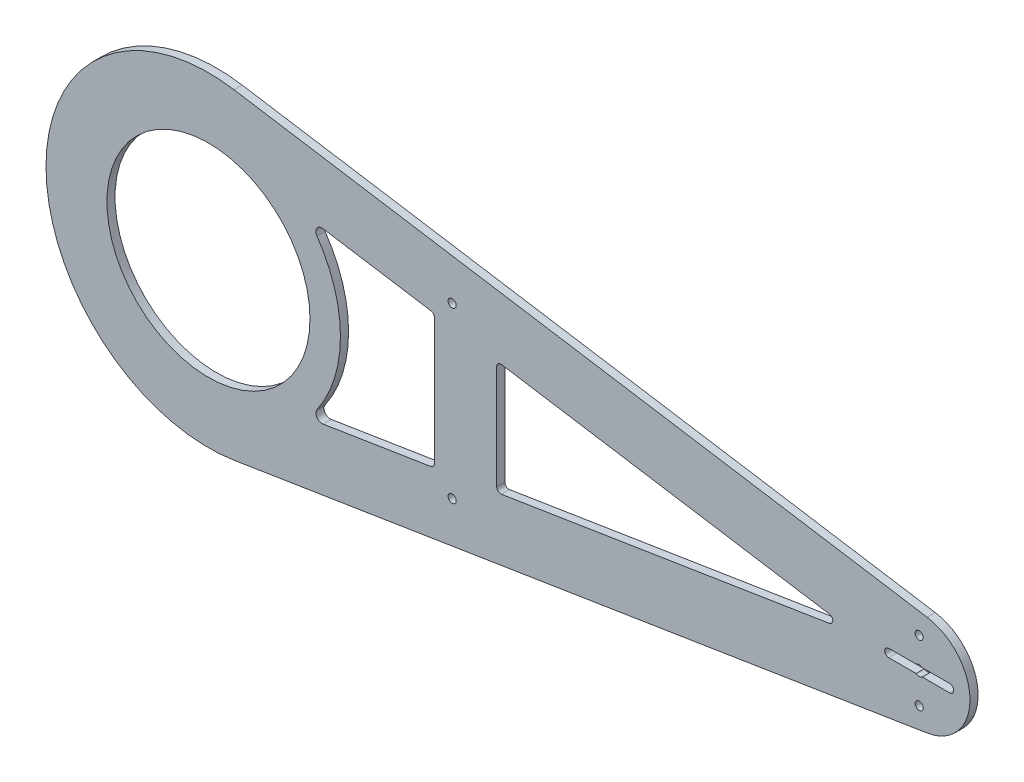
ISO-10303-21;
HEADER;
FILE_DESCRIPTION(('STEP AP214'),'2;1');
FILE_NAME('part.step','',(''),(''),'','','');
FILE_SCHEMA(('AUTOMOTIVE_DESIGN { 1 0 10303 214 1 1 1 1 }'));
ENDSEC;
DATA;
#1=APPLICATION_CONTEXT('core data for automotive mechanical design processes');
#2=APPLICATION_PROTOCOL_DEFINITION('international standard','automotive_design',2000,#1);
#3=PRODUCT_CONTEXT('',#1,'mechanical');
#4=PRODUCT('Part','Part','',(#3));
#5=PRODUCT_RELATED_PRODUCT_CATEGORY('part','',(#4));
#6=PRODUCT_DEFINITION_FORMATION('','',#4);
#7=PRODUCT_DEFINITION_CONTEXT('part definition',#1,'design');
#8=PRODUCT_DEFINITION('design','',#6,#7);
#9=PRODUCT_DEFINITION_SHAPE('','',#8);
#10=(LENGTH_UNIT() NAMED_UNIT(*) SI_UNIT(.MILLI.,.METRE.));
#11=(NAMED_UNIT(*) PLANE_ANGLE_UNIT() SI_UNIT($,.RADIAN.));
#12=(NAMED_UNIT(*) SI_UNIT($,.STERADIAN.) SOLID_ANGLE_UNIT());
#13=UNCERTAINTY_MEASURE_WITH_UNIT(LENGTH_MEASURE(1.E-05),#10,'distance_accuracy_value','');
#14=(GEOMETRIC_REPRESENTATION_CONTEXT(3) GLOBAL_UNCERTAINTY_ASSIGNED_CONTEXT((#13)) GLOBAL_UNIT_ASSIGNED_CONTEXT((#10,
#11,#12)) REPRESENTATION_CONTEXT('',''));
#15=CARTESIAN_POINT('',(0.,0.,0.));
#16=DIRECTION('',(0.,0.,1.));
#17=DIRECTION('',(1.,0.,0.));
#18=AXIS2_PLACEMENT_3D('',#15,#16,#17);
#19=CARTESIAN_POINT('',(0.,0.,-4.));
#20=DIRECTION('',(0.,0.,1.));
#21=DIRECTION('',(1.,0.,0.));
#22=AXIS2_PLACEMENT_3D('',#19,#20,#21);
#23=PLANE('',#22);
#24=CARTESIAN_POINT('',(0.,0.,-4.));
#25=DIRECTION('',(0.,0.,1.));
#26=DIRECTION('',(1.,0.,0.));
#27=AXIS2_PLACEMENT_3D('',#24,#25,#26);
#28=CIRCLE('',#27,50.);
#29=CARTESIAN_POINT('',(50.,0.,-4.));
#30=VERTEX_POINT('',#29);
#31=EDGE_CURVE('E621',#30,#30,#28,.T.);
#32=ORIENTED_EDGE('',*,*,#31,.T.);
#33=EDGE_LOOP('',(#32));
#34=FACE_BOUND('',#33,.T.);
#35=CARTESIAN_POINT('',(120.,41.6604515138636,-4.));
#36=DIRECTION('',(0.,0.,1.));
#37=DIRECTION('',(1.,0.,0.));
#38=AXIS2_PLACEMENT_3D('',#35,#36,#37);
#39=CIRCLE('',#38,2.);
#40=CARTESIAN_POINT('',(122.,41.6604515138636,-4.));
#41=VERTEX_POINT('',#40);
#42=EDGE_CURVE('E634',#41,#41,#39,.T.);
#43=ORIENTED_EDGE('',*,*,#42,.T.);
#44=EDGE_LOOP('',(#43));
#45=FACE_BOUND('',#44,.T.);
#46=CARTESIAN_POINT('',(120.,-41.6604515138637,-4.));
#47=DIRECTION('',(0.,0.,1.));
#48=DIRECTION('',(1.,0.,0.));
#49=AXIS2_PLACEMENT_3D('',#46,#47,#48);
#50=CIRCLE('',#49,2.);
#51=CARTESIAN_POINT('',(122.,-41.6604515138637,-4.));
#52=VERTEX_POINT('',#51);
#53=EDGE_CURVE('E630',#52,#52,#50,.T.);
#54=ORIENTED_EDGE('',*,*,#53,.T.);
#55=EDGE_LOOP('',(#54));
#56=FACE_BOUND('',#55,.T.);
#57=CARTESIAN_POINT('',(350.,15.,-4.));
#58=DIRECTION('',(0.,0.,1.));
#59=DIRECTION('',(1.,0.,0.));
#60=AXIS2_PLACEMENT_3D('',#57,#58,#59);
#61=CIRCLE('',#60,2.);
#62=CARTESIAN_POINT('',(352.,15.,-4.));
#63=VERTEX_POINT('',#62);
#64=EDGE_CURVE('E367',#63,#63,#61,.T.);
#65=ORIENTED_EDGE('',*,*,#64,.T.);
#66=EDGE_LOOP('',(#65));
#67=FACE_BOUND('',#66,.T.);
#68=CARTESIAN_POINT('',(350.,-15.,-4.));
#69=DIRECTION('',(0.,0.,1.));
#70=DIRECTION('',(1.,0.,0.));
#71=AXIS2_PLACEMENT_3D('',#68,#69,#70);
#72=CIRCLE('',#71,1.99999999999994);
#73=CARTESIAN_POINT('',(352.,-15.,-4.));
#74=VERTEX_POINT('',#73);
#75=EDGE_CURVE('E361',#74,#74,#72,.T.);
#76=ORIENTED_EDGE('',*,*,#75,.T.);
#77=EDGE_LOOP('',(#76));
#78=FACE_BOUND('',#77,.T.);
#79=DIRECTION('',(0.,-1.,0.));
#80=VECTOR('',#79,1.);
#81=CARTESIAN_POINT('',(141.940088648361,0.,-4.));
#82=LINE('',#81,#80);
#83=CARTESIAN_POINT('',(141.940088648361,25.7001448479802,-4.));
#84=VERTEX_POINT('',#83);
#85=CARTESIAN_POINT('',(141.940088648361,-25.7001448479802,-4.));
#86=VERTEX_POINT('',#85);
#87=EDGE_CURVE('E354',#84,#86,#82,.T.);
#88=ORIENTED_EDGE('',*,*,#87,.T.);
#89=CARTESIAN_POINT('',(143.940088648361,-25.7001448479802,-4.));
#90=DIRECTION('',(0.,0.,1.));
#91=DIRECTION('',(1.,0.,0.));
#92=AXIS2_PLACEMENT_3D('',#89,#90,#91);
#93=CIRCLE('',#92,2.);
#94=CARTESIAN_POINT('',(144.254374362647,-27.6752966117178,-4.));
#95=VERTEX_POINT('',#94);
#96=EDGE_CURVE('E444',#86,#95,#93,.T.);
#97=ORIENTED_EDGE('',*,*,#96,.T.);
#98=DIRECTION('',(0.987575881868821,0.157142857142857,0.));
#99=VECTOR('',#98,1.);
#100=CARTESIAN_POINT('',(7.85714285714286,-49.3787940934411,-4.));
#101=LINE('',#100,#99);
#102=CARTESIAN_POINT('',(305.768831168831,-1.97515176373764,-4.));
#103=VERTEX_POINT('',#102);
#104=EDGE_CURVE('E357',#95,#103,#101,.T.);
#105=ORIENTED_EDGE('',*,*,#104,.T.);
#106=CARTESIAN_POINT('',(305.454545454546,0.,-4.));
#107=DIRECTION('',(0.,0.,1.));
#108=DIRECTION('',(1.,0.,0.));
#109=AXIS2_PLACEMENT_3D('',#106,#107,#108);
#110=CIRCLE('',#109,2.);
#111=CARTESIAN_POINT('',(305.768831168831,1.97515176373764,-4.));
#112=VERTEX_POINT('',#111);
#113=EDGE_CURVE('E12',#103,#112,#110,.T.);
#114=ORIENTED_EDGE('',*,*,#113,.T.);
#115=DIRECTION('',(-0.987575881868821,0.157142857142857,0.));
#116=VECTOR('',#115,1.);
#117=CARTESIAN_POINT('',(7.85714285714286,49.3787940934411,-4.));
#118=LINE('',#117,#116);
#119=CARTESIAN_POINT('',(144.254374362647,27.6752966117178,-4.));
#120=VERTEX_POINT('',#119);
#121=EDGE_CURVE('E359',#112,#120,#118,.T.);
#122=ORIENTED_EDGE('',*,*,#121,.T.);
#123=CARTESIAN_POINT('',(143.940088648361,25.7001448479802,-4.));
#124=DIRECTION('',(0.,0.,1.));
#125=DIRECTION('',(1.,0.,0.));
#126=AXIS2_PLACEMENT_3D('',#123,#124,#125);
#127=CIRCLE('',#126,2.);
#128=EDGE_CURVE('E448',#120,#84,#127,.T.);
#129=ORIENTED_EDGE('',*,*,#128,.T.);
#130=EDGE_LOOP('',(#88,#97,#105,#114,#122,#129));
#131=FACE_BOUND('',#130,.T.);
#132=DIRECTION('',(0.987575881868821,0.157142857142857,0.));
#133=VECTOR('',#132,1.);
#134=CARTESIAN_POINT('',(7.85714285714287,-49.3787940934411,-4.));
#135=LINE('',#134,#133);
#136=CARTESIAN_POINT('',(56.389238275683,-41.656377743249,-4.));
#137=VERTEX_POINT('',#136);
#138=CARTESIAN_POINT('',(109.609148615213,-33.1880373137372,-4.));
#139=VERTEX_POINT('',#138);
#140=EDGE_CURVE('E346',#137,#139,#135,.T.);
#141=ORIENTED_EDGE('',*,*,#140,.T.);
#142=CARTESIAN_POINT('',(109.294862900928,-31.2128855499996,-4.));
#143=DIRECTION('',(0.,0.,1.));
#144=DIRECTION('',(1.,0.,0.));
#145=AXIS2_PLACEMENT_3D('',#142,#143,#144);
#146=CIRCLE('',#145,2.);
#147=CARTESIAN_POINT('',(111.294862900928,-31.2128855499996,-4.));
#148=VERTEX_POINT('',#147);
#149=EDGE_CURVE('E440',#139,#148,#146,.T.);
#150=ORIENTED_EDGE('',*,*,#149,.T.);
#151=DIRECTION('',(0.,1.,0.));
#152=VECTOR('',#151,1.);
#153=CARTESIAN_POINT('',(111.294862900928,0.,-4.));
#154=LINE('',#153,#152);
#155=CARTESIAN_POINT('',(111.294862900928,31.2128855499996,-4.));
#156=VERTEX_POINT('',#155);
#157=EDGE_CURVE('E349',#148,#156,#154,.T.);
#158=ORIENTED_EDGE('',*,*,#157,.T.);
#159=CARTESIAN_POINT('',(109.294862900928,31.2128855499996,-4.));
#160=DIRECTION('',(0.,0.,1.));
#161=DIRECTION('',(1.,0.,0.));
#162=AXIS2_PLACEMENT_3D('',#159,#160,#161);
#163=CIRCLE('',#162,2.);
#164=CARTESIAN_POINT('',(109.609148615213,33.1880373137372,-4.));
#165=VERTEX_POINT('',#164);
#166=EDGE_CURVE('E436',#156,#165,#163,.T.);
#167=ORIENTED_EDGE('',*,*,#166,.T.);
#168=DIRECTION('',(-0.987575881868821,0.157142857142857,0.));
#169=VECTOR('',#168,1.);
#170=CARTESIAN_POINT('',(7.85714285714287,49.3787940934411,-4.));
#171=LINE('',#170,#169);
#172=CARTESIAN_POINT('',(56.389238275683,41.656377743249,-4.));
#173=VERTEX_POINT('',#172);
#174=EDGE_CURVE('E352',#165,#173,#171,.T.);
#175=ORIENTED_EDGE('',*,*,#174,.T.);
#176=CARTESIAN_POINT('',(55.9178097042545,38.6936500976425,-4.));
#177=DIRECTION('',(0.,0.,1.));
#178=DIRECTION('',(1.,0.,0.));
#179=AXIS2_PLACEMENT_3D('',#176,#177,#178);
#180=CIRCLE('',#179,3.00000000000002);
#181=CARTESIAN_POINT('',(53.4508475114197,36.9865772992171,-4.));
#182=VERTEX_POINT('',#181);
#183=EDGE_CURVE('E289',#173,#182,#180,.T.);
#184=ORIENTED_EDGE('',*,*,#183,.T.);
#185=CARTESIAN_POINT('',(0.,0.,-4.));
#186=DIRECTION('',(0.,0.,1.));
#187=DIRECTION('',(1.,0.,0.));
#188=AXIS2_PLACEMENT_3D('',#185,#186,#187);
#189=CIRCLE('',#188,65.);
#190=CARTESIAN_POINT('',(53.4508475114197,-36.9865772992171,-4.));
#191=VERTEX_POINT('',#190);
#192=EDGE_CURVE('E293',#182,#191,#189,.F.);
#193=ORIENTED_EDGE('',*,*,#192,.T.);
#194=CARTESIAN_POINT('',(55.9178097042545,-38.6936500976425,-4.));
#195=DIRECTION('',(0.,0.,1.));
#196=DIRECTION('',(1.,0.,0.));
#197=AXIS2_PLACEMENT_3D('',#194,#195,#196);
#198=CIRCLE('',#197,3.00000000000002);
#199=EDGE_CURVE('E343',#191,#137,#198,.T.);
#200=ORIENTED_EDGE('',*,*,#199,.T.);
#201=EDGE_LOOP('',(#141,#150,#158,#167,#175,#184,#193,#200));
#202=FACE_BOUND('',#201,.T.);
#203=CARTESIAN_POINT('',(0.,0.,-4.));
#204=DIRECTION('',(0.,0.,1.));
#205=DIRECTION('',(1.,0.,0.));
#206=AXIS2_PLACEMENT_3D('',#203,#204,#205);
#207=CIRCLE('',#206,80.);
#208=CARTESIAN_POINT('',(12.5714285714286,79.0060705495057,-4.));
#209=VERTEX_POINT('',#208);
#210=CARTESIAN_POINT('',(12.5714285714286,-79.0060705495057,-4.));
#211=VERTEX_POINT('',#210);
#212=EDGE_CURVE('E379',#209,#211,#207,.T.);
#213=ORIENTED_EDGE('',*,*,#212,.F.);
#214=DIRECTION('',(-0.987575881868821,0.157142857142857,0.));
#215=VECTOR('',#214,1.);
#216=CARTESIAN_POINT('',(12.5714285714286,79.0060705495057,-4.));
#217=LINE('',#216,#215);
#218=CARTESIAN_POINT('',(353.928571428571,24.6893970467205,-4.));
#219=VERTEX_POINT('',#218);
#220=EDGE_CURVE('E389',#219,#209,#217,.T.);
#221=ORIENTED_EDGE('',*,*,#220,.F.);
#222=CARTESIAN_POINT('',(350.,0.,-4.));
#223=DIRECTION('',(0.,0.,1.));
#224=DIRECTION('',(1.,0.,0.));
#225=AXIS2_PLACEMENT_3D('',#222,#223,#224);
#226=CIRCLE('',#225,25.);
#227=CARTESIAN_POINT('',(353.928571428571,-24.6893970467205,-4.));
#228=VERTEX_POINT('',#227);
#229=EDGE_CURVE('E386',#228,#219,#226,.T.);
#230=ORIENTED_EDGE('',*,*,#229,.F.);
#231=DIRECTION('',(0.987575881868821,0.157142857142857,0.));
#232=VECTOR('',#231,1.);
#233=CARTESIAN_POINT('',(12.5714285714286,-79.0060705495057,-4.));
#234=LINE('',#233,#232);
#235=EDGE_CURVE('E382',#211,#228,#234,.T.);
#236=ORIENTED_EDGE('',*,*,#235,.F.);
#237=EDGE_LOOP('',(#213,#221,#230,#236));
#238=FACE_BOUND('',#237,.T.);
#239=DIRECTION('',(1.,0.,0.));
#240=VECTOR('',#239,1.);
#241=CARTESIAN_POINT('',(0.,1.99999999999879,-4.));
#242=LINE('',#241,#240);
#243=CARTESIAN_POINT('',(351.5,2.00000000000006,-4.));
#244=VERTEX_POINT('',#243);
#245=CARTESIAN_POINT('',(365.,2.,-4.));
#246=VERTEX_POINT('',#245);
#247=EDGE_CURVE('E267',#244,#246,#242,.T.);
#248=ORIENTED_EDGE('',*,*,#247,.F.);
#249=CARTESIAN_POINT('',(350.,0.,-4.));
#250=DIRECTION('',(0.,0.,1.));
#251=DIRECTION('',(1.,0.,0.));
#252=AXIS2_PLACEMENT_3D('',#249,#250,#251);
#253=CIRCLE('',#252,2.50000000000002);
#254=CARTESIAN_POINT('',(348.5,2.00000000000005,-4.));
#255=VERTEX_POINT('',#254);
#256=EDGE_CURVE('E375',#244,#255,#253,.T.);
#257=ORIENTED_EDGE('',*,*,#256,.T.);
#258=DIRECTION('',(1.,0.,0.));
#259=VECTOR('',#258,1.);
#260=CARTESIAN_POINT('',(0.,1.99999999999879,-4.));
#261=LINE('',#260,#259);
#262=CARTESIAN_POINT('',(335.,2.,-4.));
#263=VERTEX_POINT('',#262);
#264=EDGE_CURVE('E650',#263,#255,#261,.T.);
#265=ORIENTED_EDGE('',*,*,#264,.F.);
#266=CARTESIAN_POINT('',(335.,0.,-4.));
#267=DIRECTION('',(0.,0.,1.));
#268=DIRECTION('',(1.,0.,0.));
#269=AXIS2_PLACEMENT_3D('',#266,#267,#268);
#270=CIRCLE('',#269,2.);
#271=CARTESIAN_POINT('',(335.,-2.,-4.));
#272=VERTEX_POINT('',#271);
#273=EDGE_CURVE('E364',#263,#272,#270,.T.);
#274=ORIENTED_EDGE('',*,*,#273,.T.);
#275=DIRECTION('',(1.,0.,0.));
#276=VECTOR('',#275,1.);
#277=CARTESIAN_POINT('',(0.,-1.99999999999879,-4.));
#278=LINE('',#277,#276);
#279=CARTESIAN_POINT('',(348.5,-2.00000000000005,-4.));
#280=VERTEX_POINT('',#279);
#281=EDGE_CURVE('E637',#272,#280,#278,.T.);
#282=ORIENTED_EDGE('',*,*,#281,.T.);
#283=CARTESIAN_POINT('',(351.5,-2.00000000000006,-4.));
#284=VERTEX_POINT('',#283);
#285=EDGE_CURVE('E374',#280,#284,#253,.T.);
#286=ORIENTED_EDGE('',*,*,#285,.T.);
#287=DIRECTION('',(1.,0.,0.));
#288=VECTOR('',#287,1.);
#289=CARTESIAN_POINT('',(0.,-1.99999999999879,-4.));
#290=LINE('',#289,#288);
#291=CARTESIAN_POINT('',(365.,-2.,-4.));
#292=VERTEX_POINT('',#291);
#293=EDGE_CURVE('E639',#284,#292,#290,.T.);
#294=ORIENTED_EDGE('',*,*,#293,.T.);
#295=CARTESIAN_POINT('',(365.,0.,-4.));
#296=DIRECTION('',(0.,0.,1.));
#297=DIRECTION('',(1.,0.,0.));
#298=AXIS2_PLACEMENT_3D('',#295,#296,#297);
#299=CIRCLE('',#298,2.);
#300=EDGE_CURVE('E370',#292,#246,#299,.T.);
#301=ORIENTED_EDGE('',*,*,#300,.T.);
#302=EDGE_LOOP('',(#248,#257,#265,#274,#282,#286,#294,#301));
#303=FACE_BOUND('',#302,.T.);
#304=ADVANCED_FACE('F89',(#34,#45,#56,#67,#78,#131,#202,#238,#303),#23,.F.);
#305=CARTESIAN_POINT('',(0.,0.,0.));
#306=DIRECTION('',(0.,0.,1.));
#307=DIRECTION('',(1.,0.,0.));
#308=AXIS2_PLACEMENT_3D('',#305,#306,#307);
#309=PLANE('',#308);
#310=CARTESIAN_POINT('',(0.,0.,0.));
#311=DIRECTION('',(0.,0.,1.));
#312=DIRECTION('',(1.,0.,0.));
#313=AXIS2_PLACEMENT_3D('',#310,#311,#312);
#314=CIRCLE('',#313,50.);
#315=CARTESIAN_POINT('',(50.,0.,0.));
#316=VERTEX_POINT('',#315);
#317=EDGE_CURVE('E619',#316,#316,#314,.T.);
#318=ORIENTED_EDGE('',*,*,#317,.F.);
#319=EDGE_LOOP('',(#318));
#320=FACE_BOUND('',#319,.T.);
#321=CARTESIAN_POINT('',(120.,41.6604515138636,0.));
#322=DIRECTION('',(0.,0.,1.));
#323=DIRECTION('',(1.,0.,0.));
#324=AXIS2_PLACEMENT_3D('',#321,#322,#323);
#325=CIRCLE('',#324,2.);
#326=CARTESIAN_POINT('',(122.,41.6604515138636,0.));
#327=VERTEX_POINT('',#326);
#328=EDGE_CURVE('E625',#327,#327,#325,.T.);
#329=ORIENTED_EDGE('',*,*,#328,.F.);
#330=EDGE_LOOP('',(#329));
#331=FACE_BOUND('',#330,.T.);
#332=CARTESIAN_POINT('',(120.,-41.6604515138637,0.));
#333=DIRECTION('',(0.,0.,1.));
#334=DIRECTION('',(1.,0.,0.));
#335=AXIS2_PLACEMENT_3D('',#332,#333,#334);
#336=CIRCLE('',#335,2.);
#337=CARTESIAN_POINT('',(122.,-41.6604515138637,0.));
#338=VERTEX_POINT('',#337);
#339=EDGE_CURVE('E622',#338,#338,#336,.T.);
#340=ORIENTED_EDGE('',*,*,#339,.F.);
#341=EDGE_LOOP('',(#340));
#342=FACE_BOUND('',#341,.T.);
#343=CARTESIAN_POINT('',(350.,15.,0.));
#344=DIRECTION('',(0.,0.,1.));
#345=DIRECTION('',(1.,0.,0.));
#346=AXIS2_PLACEMENT_3D('',#343,#344,#345);
#347=CIRCLE('',#346,2.);
#348=CARTESIAN_POINT('',(352.,15.,0.));
#349=VERTEX_POINT('',#348);
#350=EDGE_CURVE('E306',#349,#349,#347,.T.);
#351=ORIENTED_EDGE('',*,*,#350,.F.);
#352=EDGE_LOOP('',(#351));
#353=FACE_BOUND('',#352,.T.);
#354=CARTESIAN_POINT('',(350.,-15.,0.));
#355=DIRECTION('',(0.,0.,1.));
#356=DIRECTION('',(1.,0.,0.));
#357=AXIS2_PLACEMENT_3D('',#354,#355,#356);
#358=CIRCLE('',#357,1.99999999999994);
#359=CARTESIAN_POINT('',(352.,-15.,0.));
#360=VERTEX_POINT('',#359);
#361=EDGE_CURVE('E305',#360,#360,#358,.T.);
#362=ORIENTED_EDGE('',*,*,#361,.F.);
#363=EDGE_LOOP('',(#362));
#364=FACE_BOUND('',#363,.T.);
#365=DIRECTION('',(-0.987575881868821,0.157142857142857,0.));
#366=VECTOR('',#365,1.);
#367=CARTESIAN_POINT('',(141.940088648361,28.043545245635,0.));
#368=LINE('',#367,#366);
#369=CARTESIAN_POINT('',(305.768831168831,1.97515176373765,0.));
#370=VERTEX_POINT('',#369);
#371=CARTESIAN_POINT('',(144.254374362647,27.6752966117178,0.));
#372=VERTEX_POINT('',#371);
#373=EDGE_CURVE('E310',#370,#372,#368,.T.);
#374=ORIENTED_EDGE('',*,*,#373,.F.);
#375=CARTESIAN_POINT('',(305.454545454546,0.,0.));
#376=DIRECTION('',(0.,0.,1.));
#377=DIRECTION('',(1.,0.,0.));
#378=AXIS2_PLACEMENT_3D('',#375,#376,#377);
#379=CIRCLE('',#378,2.);
#380=CARTESIAN_POINT('',(305.768831168831,-1.97515176373765,0.));
#381=VERTEX_POINT('',#380);
#382=EDGE_CURVE('E97',#370,#381,#379,.F.);
#383=ORIENTED_EDGE('',*,*,#382,.T.);
#384=DIRECTION('',(0.987575881868821,0.157142857142857,0.));
#385=VECTOR('',#384,1.);
#386=CARTESIAN_POINT('',(141.940088648361,-28.043545245635,0.));
#387=LINE('',#386,#385);
#388=CARTESIAN_POINT('',(144.254374362647,-27.6752966117178,0.));
#389=VERTEX_POINT('',#388);
#390=EDGE_CURVE('E290',#389,#381,#387,.T.);
#391=ORIENTED_EDGE('',*,*,#390,.F.);
#392=CARTESIAN_POINT('',(143.940088648361,-25.7001448479802,0.));
#393=DIRECTION('',(0.,0.,1.));
#394=DIRECTION('',(1.,0.,0.));
#395=AXIS2_PLACEMENT_3D('',#392,#393,#394);
#396=CIRCLE('',#395,2.);
#397=CARTESIAN_POINT('',(141.940088648361,-25.7001448479802,0.));
#398=VERTEX_POINT('',#397);
#399=EDGE_CURVE('E442',#389,#398,#396,.F.);
#400=ORIENTED_EDGE('',*,*,#399,.T.);
#401=DIRECTION('',(0.,-1.,0.));
#402=VECTOR('',#401,1.);
#403=CARTESIAN_POINT('',(141.940088648361,28.043545245635,0.));
#404=LINE('',#403,#402);
#405=CARTESIAN_POINT('',(141.940088648361,25.7001448479802,0.));
#406=VERTEX_POINT('',#405);
#407=EDGE_CURVE('E296',#406,#398,#404,.T.);
#408=ORIENTED_EDGE('',*,*,#407,.F.);
#409=CARTESIAN_POINT('',(143.940088648361,25.7001448479802,0.));
#410=DIRECTION('',(0.,0.,1.));
#411=DIRECTION('',(1.,0.,0.));
#412=AXIS2_PLACEMENT_3D('',#409,#410,#411);
#413=CIRCLE('',#412,2.);
#414=EDGE_CURVE('E446',#406,#372,#413,.F.);
#415=ORIENTED_EDGE('',*,*,#414,.T.);
#416=EDGE_LOOP('',(#374,#383,#391,#400,#408,#415));
#417=FACE_BOUND('',#416,.T.);
#418=DIRECTION('',(-0.987575881868821,0.157142857142857,0.));
#419=VECTOR('',#418,1.);
#420=CARTESIAN_POINT('',(56.389238275683,41.656377743249,0.));
#421=LINE('',#420,#419);
#422=CARTESIAN_POINT('',(109.609148615213,33.1880373137372,0.));
#423=VERTEX_POINT('',#422);
#424=CARTESIAN_POINT('',(56.389238275683,41.656377743249,0.));
#425=VERTEX_POINT('',#424);
#426=EDGE_CURVE('E316',#423,#425,#421,.T.);
#427=ORIENTED_EDGE('',*,*,#426,.F.);
#428=CARTESIAN_POINT('',(109.294862900928,31.2128855499996,0.));
#429=DIRECTION('',(0.,0.,1.));
#430=DIRECTION('',(1.,0.,0.));
#431=AXIS2_PLACEMENT_3D('',#428,#429,#430);
#432=CIRCLE('',#431,2.);
#433=CARTESIAN_POINT('',(111.294862900928,31.2128855499996,0.));
#434=VERTEX_POINT('',#433);
#435=EDGE_CURVE('E434',#423,#434,#432,.F.);
#436=ORIENTED_EDGE('',*,*,#435,.T.);
#437=DIRECTION('',(0.,1.,0.));
#438=VECTOR('',#437,1.);
#439=CARTESIAN_POINT('',(111.294862900928,32.9198068273037,0.));
#440=LINE('',#439,#438);
#441=CARTESIAN_POINT('',(111.294862900928,-31.2128855499996,0.));
#442=VERTEX_POINT('',#441);
#443=EDGE_CURVE('E330',#442,#434,#440,.T.);
#444=ORIENTED_EDGE('',*,*,#443,.F.);
#445=CARTESIAN_POINT('',(109.294862900928,-31.2128855499996,0.));
#446=DIRECTION('',(0.,0.,1.));
#447=DIRECTION('',(1.,0.,0.));
#448=AXIS2_PLACEMENT_3D('',#445,#446,#447);
#449=CIRCLE('',#448,2.);
#450=CARTESIAN_POINT('',(109.609148615213,-33.1880373137372,0.));
#451=VERTEX_POINT('',#450);
#452=EDGE_CURVE('E438',#442,#451,#449,.F.);
#453=ORIENTED_EDGE('',*,*,#452,.T.);
#454=DIRECTION('',(0.987575881868821,0.157142857142857,0.));
#455=VECTOR('',#454,1.);
#456=CARTESIAN_POINT('',(56.389238275683,-41.656377743249,0.));
#457=LINE('',#456,#455);
#458=CARTESIAN_POINT('',(56.389238275683,-41.656377743249,0.));
#459=VERTEX_POINT('',#458);
#460=EDGE_CURVE('E327',#459,#451,#457,.T.);
#461=ORIENTED_EDGE('',*,*,#460,.F.);
#462=CARTESIAN_POINT('',(55.9178097042545,-38.6936500976425,0.));
#463=DIRECTION('',(0.,0.,1.));
#464=DIRECTION('',(1.,0.,0.));
#465=AXIS2_PLACEMENT_3D('',#462,#463,#464);
#466=CIRCLE('',#465,3.00000000000002);
#467=CARTESIAN_POINT('',(53.4508475114197,-36.9865772992171,0.));
#468=VERTEX_POINT('',#467);
#469=EDGE_CURVE('E324',#468,#459,#466,.T.);
#470=ORIENTED_EDGE('',*,*,#469,.F.);
#471=CARTESIAN_POINT('',(0.,0.,0.));
#472=DIRECTION('',(0.,0.,-1.));
#473=DIRECTION('',(1.,0.,0.));
#474=AXIS2_PLACEMENT_3D('',#471,#472,#473);
#475=CIRCLE('',#474,65.);
#476=CARTESIAN_POINT('',(53.4508475114197,36.9865772992171,0.));
#477=VERTEX_POINT('',#476);
#478=EDGE_CURVE('E321',#477,#468,#475,.T.);
#479=ORIENTED_EDGE('',*,*,#478,.F.);
#480=CARTESIAN_POINT('',(55.9178097042545,38.6936500976425,0.));
#481=DIRECTION('',(0.,0.,1.));
#482=DIRECTION('',(-1.,0.,0.));
#483=AXIS2_PLACEMENT_3D('',#480,#481,#482);
#484=CIRCLE('',#483,3.00000000000002);
#485=EDGE_CURVE('E318',#425,#477,#484,.T.);
#486=ORIENTED_EDGE('',*,*,#485,.F.);
#487=EDGE_LOOP('',(#427,#436,#444,#453,#461,#470,#479,#486));
#488=FACE_BOUND('',#487,.T.);
#489=CARTESIAN_POINT('',(0.,0.,0.));
#490=DIRECTION('',(0.,0.,1.));
#491=DIRECTION('',(1.,0.,0.));
#492=AXIS2_PLACEMENT_3D('',#489,#490,#491);
#493=CIRCLE('',#492,80.);
#494=CARTESIAN_POINT('',(12.5714285714286,79.0060705495057,0.));
#495=VERTEX_POINT('',#494);
#496=CARTESIAN_POINT('',(12.5714285714286,-79.0060705495057,0.));
#497=VERTEX_POINT('',#496);
#498=EDGE_CURVE('E378',#495,#497,#493,.T.);
#499=ORIENTED_EDGE('',*,*,#498,.T.);
#500=DIRECTION('',(0.987575881868821,0.157142857142857,0.));
#501=VECTOR('',#500,1.);
#502=CARTESIAN_POINT('',(12.5714285714286,-79.0060705495057,0.));
#503=LINE('',#502,#501);
#504=CARTESIAN_POINT('',(353.928571428571,-24.6893970467205,0.));
#505=VERTEX_POINT('',#504);
#506=EDGE_CURVE('E395',#497,#505,#503,.T.);
#507=ORIENTED_EDGE('',*,*,#506,.T.);
#508=CARTESIAN_POINT('',(350.,0.,0.));
#509=DIRECTION('',(0.,0.,1.));
#510=DIRECTION('',(1.,0.,0.));
#511=AXIS2_PLACEMENT_3D('',#508,#509,#510);
#512=CIRCLE('',#511,25.);
#513=CARTESIAN_POINT('',(353.928571428571,24.6893970467205,0.));
#514=VERTEX_POINT('',#513);
#515=EDGE_CURVE('E398',#505,#514,#512,.T.);
#516=ORIENTED_EDGE('',*,*,#515,.T.);
#517=DIRECTION('',(-0.987575881868821,0.157142857142857,0.));
#518=VECTOR('',#517,1.);
#519=CARTESIAN_POINT('',(12.5714285714286,79.0060705495057,0.));
#520=LINE('',#519,#518);
#521=EDGE_CURVE('E383',#514,#495,#520,.T.);
#522=ORIENTED_EDGE('',*,*,#521,.T.);
#523=EDGE_LOOP('',(#499,#507,#516,#522));
#524=FACE_BOUND('',#523,.T.);
#525=CARTESIAN_POINT('',(350.,0.,0.));
#526=DIRECTION('',(0.,0.,1.));
#527=DIRECTION('',(1.,0.,0.));
#528=AXIS2_PLACEMENT_3D('',#525,#526,#527);
#529=CIRCLE('',#528,2.50000000000002);
#530=CARTESIAN_POINT('',(351.5,2.00000000000006,0.));
#531=VERTEX_POINT('',#530);
#532=CARTESIAN_POINT('',(348.5,2.,0.));
#533=VERTEX_POINT('',#532);
#534=EDGE_CURVE('E283',#531,#533,#529,.T.);
#535=ORIENTED_EDGE('',*,*,#534,.F.);
#536=DIRECTION('',(1.,0.,0.));
#537=VECTOR('',#536,1.);
#538=CARTESIAN_POINT('',(0.,2.00000000000006,0.));
#539=LINE('',#538,#537);
#540=CARTESIAN_POINT('',(365.,2.,0.));
#541=VERTEX_POINT('',#540);
#542=EDGE_CURVE('E264',#531,#541,#539,.T.);
#543=ORIENTED_EDGE('',*,*,#542,.T.);
#544=CARTESIAN_POINT('',(365.,0.,0.));
#545=DIRECTION('',(0.,0.,1.));
#546=DIRECTION('',(1.,0.,0.));
#547=AXIS2_PLACEMENT_3D('',#544,#545,#546);
#548=CIRCLE('',#547,2.);
#549=CARTESIAN_POINT('',(365.,-2.,0.));
#550=VERTEX_POINT('',#549);
#551=EDGE_CURVE('E280',#550,#541,#548,.T.);
#552=ORIENTED_EDGE('',*,*,#551,.F.);
#553=DIRECTION('',(1.,0.,0.));
#554=VECTOR('',#553,1.);
#555=CARTESIAN_POINT('',(0.,-2.00000000000006,0.));
#556=LINE('',#555,#554);
#557=CARTESIAN_POINT('',(351.5,-2.00000000000006,0.));
#558=VERTEX_POINT('',#557);
#559=EDGE_CURVE('E285',#558,#550,#556,.T.);
#560=ORIENTED_EDGE('',*,*,#559,.F.);
#561=CARTESIAN_POINT('',(348.5,-2.,0.));
#562=VERTEX_POINT('',#561);
#563=EDGE_CURVE('E372',#562,#558,#529,.T.);
#564=ORIENTED_EDGE('',*,*,#563,.F.);
#565=DIRECTION('',(1.,0.,0.));
#566=VECTOR('',#565,1.);
#567=CARTESIAN_POINT('',(0.,-2.,0.));
#568=LINE('',#567,#566);
#569=CARTESIAN_POINT('',(335.,-2.,0.));
#570=VERTEX_POINT('',#569);
#571=EDGE_CURVE('E647',#570,#562,#568,.T.);
#572=ORIENTED_EDGE('',*,*,#571,.F.);
#573=CARTESIAN_POINT('',(335.,0.,0.));
#574=DIRECTION('',(0.,0.,1.));
#575=DIRECTION('',(1.,0.,0.));
#576=AXIS2_PLACEMENT_3D('',#573,#574,#575);
#577=CIRCLE('',#576,2.);
#578=CARTESIAN_POINT('',(335.,2.,0.));
#579=VERTEX_POINT('',#578);
#580=EDGE_CURVE('E302',#579,#570,#577,.T.);
#581=ORIENTED_EDGE('',*,*,#580,.F.);
#582=DIRECTION('',(1.,0.,0.));
#583=VECTOR('',#582,1.);
#584=CARTESIAN_POINT('',(0.,2.,0.));
#585=LINE('',#584,#583);
#586=EDGE_CURVE('E649',#579,#533,#585,.T.);
#587=ORIENTED_EDGE('',*,*,#586,.T.);
#588=EDGE_LOOP('',(#535,#543,#552,#560,#564,#572,#581,#587));
#589=FACE_BOUND('',#588,.T.);
#590=ADVANCED_FACE('F278',(#320,#331,#342,#353,#364,#417,#488,#524,#589),#309,.T.);
#591=CARTESIAN_POINT('',(350.,0.,-10.));
#592=DIRECTION('',(0.,0.,1.));
#593=DIRECTION('',(1.,0.,0.));
#594=AXIS2_PLACEMENT_3D('',#591,#592,#593);
#595=CYLINDRICAL_SURFACE('',#594,2.50000000000002);
#596=DIRECTION('',(0.,0.,-1.));
#597=VECTOR('',#596,1.);
#598=CARTESIAN_POINT('',(351.5,2.00000000000006,-4.));
#599=LINE('',#598,#597);
#600=EDGE_CURVE('E272',#244,#531,#599,.F.);
#601=ORIENTED_EDGE('',*,*,#600,.T.);
#602=ORIENTED_EDGE('',*,*,#534,.T.);
#603=DIRECTION('',(0.,0.,-1.));
#604=VECTOR('',#603,1.);
#605=CARTESIAN_POINT('',(348.5,2.00000000000005,-4.));
#606=LINE('',#605,#604);
#607=EDGE_CURVE('E658',#255,#533,#606,.F.);
#608=ORIENTED_EDGE('',*,*,#607,.F.);
#609=ORIENTED_EDGE('',*,*,#256,.F.);
#610=EDGE_LOOP('',(#601,#602,#608,#609));
#611=FACE_BOUND('',#610,.T.);
#612=ADVANCED_FACE('F490',(#611),#595,.F.);
#613=DIRECTION('',(0.,0.,-1.));
#614=VECTOR('',#613,1.);
#615=CARTESIAN_POINT('',(351.5,-2.00000000000006,-4.));
#616=LINE('',#615,#614);
#617=EDGE_CURVE('E284',#284,#558,#616,.F.);
#618=ORIENTED_EDGE('',*,*,#617,.F.);
#619=ORIENTED_EDGE('',*,*,#285,.F.);
#620=DIRECTION('',(0.,0.,-1.));
#621=VECTOR('',#620,1.);
#622=CARTESIAN_POINT('',(348.5,-2.00000000000005,-4.));
#623=LINE('',#622,#621);
#624=EDGE_CURVE('E655',#280,#562,#623,.F.);
#625=ORIENTED_EDGE('',*,*,#624,.T.);
#626=ORIENTED_EDGE('',*,*,#563,.T.);
#627=EDGE_LOOP('',(#618,#619,#625,#626));
#628=FACE_BOUND('',#627,.T.);
#629=ADVANCED_FACE('F589',(#628),#595,.F.);
#630=CARTESIAN_POINT('',(335.,0.,-10.));
#631=DIRECTION('',(0.,0.,1.));
#632=DIRECTION('',(1.,0.,0.));
#633=AXIS2_PLACEMENT_3D('',#630,#631,#632);
#634=CYLINDRICAL_SURFACE('',#633,2.);
#635=DIRECTION('',(0.,0.,-1.));
#636=VECTOR('',#635,1.);
#637=CARTESIAN_POINT('',(335.,2.,-4.));
#638=LINE('',#637,#636);
#639=EDGE_CURVE('E642',#263,#579,#638,.F.);
#640=ORIENTED_EDGE('',*,*,#639,.T.);
#641=ORIENTED_EDGE('',*,*,#580,.T.);
#642=DIRECTION('',(0.,0.,-1.));
#643=VECTOR('',#642,1.);
#644=CARTESIAN_POINT('',(335.,-2.,-4.));
#645=LINE('',#644,#643);
#646=EDGE_CURVE('E300',#272,#570,#645,.F.);
#647=ORIENTED_EDGE('',*,*,#646,.F.);
#648=ORIENTED_EDGE('',*,*,#273,.F.);
#649=EDGE_LOOP('',(#640,#641,#647,#648));
#650=FACE_BOUND('',#649,.T.);
#651=ADVANCED_FACE('F514',(#650),#634,.F.);
#652=CARTESIAN_POINT('',(0.,0.,-4.));
#653=DIRECTION('',(0.,0.,1.));
#654=DIRECTION('',(1.,0.,0.));
#655=AXIS2_PLACEMENT_3D('',#652,#653,#654);
#656=CYLINDRICAL_SURFACE('',#655,80.);
#657=ORIENTED_EDGE('',*,*,#498,.F.);
#658=DIRECTION('',(0.,0.,1.));
#659=VECTOR('',#658,1.);
#660=CARTESIAN_POINT('',(12.5714285714286,79.0060705495057,-4.));
#661=LINE('',#660,#659);
#662=EDGE_CURVE('E403',#209,#495,#661,.T.);
#663=ORIENTED_EDGE('',*,*,#662,.F.);
#664=ORIENTED_EDGE('',*,*,#212,.T.);
#665=DIRECTION('',(0.,0.,1.));
#666=VECTOR('',#665,1.);
#667=CARTESIAN_POINT('',(12.5714285714286,-79.0060705495057,-4.));
#668=LINE('',#667,#666);
#669=EDGE_CURVE('E392',#211,#497,#668,.T.);
#670=ORIENTED_EDGE('',*,*,#669,.T.);
#671=EDGE_LOOP('',(#657,#663,#664,#670));
#672=FACE_BOUND('',#671,.T.);
#673=ADVANCED_FACE('F502',(#672),#656,.T.);
#674=CARTESIAN_POINT('',(12.5714285714286,79.0060705495057,-4.));
#675=DIRECTION('',(0.157142857142857,0.987575881868821,0.));
#676=DIRECTION('',(-0.987575881868821,0.157142857142857,0.));
#677=AXIS2_PLACEMENT_3D('',#674,#675,#676);
#678=PLANE('',#677);
#679=ORIENTED_EDGE('',*,*,#521,.F.);
#680=DIRECTION('',(0.,0.,1.));
#681=VECTOR('',#680,1.);
#682=CARTESIAN_POINT('',(353.928571428571,24.6893970467205,-4.));
#683=LINE('',#682,#681);
#684=EDGE_CURVE('E406',#219,#514,#683,.T.);
#685=ORIENTED_EDGE('',*,*,#684,.F.);
#686=ORIENTED_EDGE('',*,*,#220,.T.);
#687=ORIENTED_EDGE('',*,*,#662,.T.);
#688=EDGE_LOOP('',(#679,#685,#686,#687));
#689=FACE_BOUND('',#688,.T.);
#690=ADVANCED_FACE('F498',(#689),#678,.T.);
#691=CARTESIAN_POINT('',(350.,0.,-4.));
#692=DIRECTION('',(0.,0.,1.));
#693=DIRECTION('',(1.,0.,0.));
#694=AXIS2_PLACEMENT_3D('',#691,#692,#693);
#695=CYLINDRICAL_SURFACE('',#694,25.);
#696=ORIENTED_EDGE('',*,*,#515,.F.);
#697=DIRECTION('',(0.,0.,1.));
#698=VECTOR('',#697,1.);
#699=CARTESIAN_POINT('',(353.928571428571,-24.6893970467205,-4.));
#700=LINE('',#699,#698);
#701=EDGE_CURVE('E408',#228,#505,#700,.T.);
#702=ORIENTED_EDGE('',*,*,#701,.F.);
#703=ORIENTED_EDGE('',*,*,#229,.T.);
#704=ORIENTED_EDGE('',*,*,#684,.T.);
#705=EDGE_LOOP('',(#696,#702,#703,#704));
#706=FACE_BOUND('',#705,.T.);
#707=ADVANCED_FACE('F501',(#706),#695,.T.);
#708=CARTESIAN_POINT('',(12.5714285714286,-79.0060705495057,-4.));
#709=DIRECTION('',(0.157142857142857,-0.987575881868821,0.));
#710=DIRECTION('',(0.987575881868821,0.157142857142857,0.));
#711=AXIS2_PLACEMENT_3D('',#708,#709,#710);
#712=PLANE('',#711);
#713=ORIENTED_EDGE('',*,*,#506,.F.);
#714=ORIENTED_EDGE('',*,*,#669,.F.);
#715=ORIENTED_EDGE('',*,*,#235,.T.);
#716=ORIENTED_EDGE('',*,*,#701,.T.);
#717=EDGE_LOOP('',(#713,#714,#715,#716));
#718=FACE_BOUND('',#717,.T.);
#719=ADVANCED_FACE('F506',(#718),#712,.T.);
#720=CARTESIAN_POINT('',(56.389238275683,41.656377743249,-10.));
#721=DIRECTION('',(0.157142857142857,0.987575881868821,0.));
#722=DIRECTION('',(-0.987575881868821,0.157142857142857,0.));
#723=AXIS2_PLACEMENT_3D('',#720,#721,#722);
#724=PLANE('',#723);
#725=ORIENTED_EDGE('',*,*,#174,.F.);
#726=DIRECTION('',(0.,0.,1.));
#727=VECTOR('',#726,1.);
#728=CARTESIAN_POINT('',(109.609148615213,33.1880373137372,0.));
#729=LINE('',#728,#727);
#730=EDGE_CURVE('E405',#165,#423,#729,.T.);
#731=ORIENTED_EDGE('',*,*,#730,.T.);
#732=ORIENTED_EDGE('',*,*,#426,.T.);
#733=DIRECTION('',(0.,0.,1.));
#734=VECTOR('',#733,1.);
#735=CARTESIAN_POINT('',(56.389238275683,41.656377743249,-10.));
#736=LINE('',#735,#734);
#737=EDGE_CURVE('E333',#173,#425,#736,.T.);
#738=ORIENTED_EDGE('',*,*,#737,.F.);
#739=EDGE_LOOP('',(#725,#731,#732,#738));
#740=FACE_BOUND('',#739,.T.);
#741=ADVANCED_FACE('F510',(#740),#724,.F.);
#742=CARTESIAN_POINT('',(111.294862900928,32.9198068273037,-10.));
#743=DIRECTION('',(1.,0.,0.));
#744=DIRECTION('',(0.,0.,-1.));
#745=AXIS2_PLACEMENT_3D('',#742,#743,#744);
#746=PLANE('',#745);
#747=ORIENTED_EDGE('',*,*,#443,.T.);
#748=DIRECTION('',(0.,0.,1.));
#749=VECTOR('',#748,1.);
#750=CARTESIAN_POINT('',(111.294862900928,31.2128855499996,-4.));
#751=LINE('',#750,#749);
#752=EDGE_CURVE('E416',#434,#156,#751,.F.);
#753=ORIENTED_EDGE('',*,*,#752,.T.);
#754=ORIENTED_EDGE('',*,*,#157,.F.);
#755=DIRECTION('',(0.,0.,1.));
#756=VECTOR('',#755,1.);
#757=CARTESIAN_POINT('',(111.294862900928,-31.2128855499996,0.));
#758=LINE('',#757,#756);
#759=EDGE_CURVE('E413',#148,#442,#758,.T.);
#760=ORIENTED_EDGE('',*,*,#759,.T.);
#761=EDGE_LOOP('',(#747,#753,#754,#760));
#762=FACE_BOUND('',#761,.T.);
#763=ADVANCED_FACE('F555',(#762),#746,.F.);
#764=CARTESIAN_POINT('',(56.389238275683,-41.656377743249,-10.));
#765=DIRECTION('',(0.157142857142857,-0.987575881868821,0.));
#766=DIRECTION('',(0.987575881868821,0.157142857142857,0.));
#767=AXIS2_PLACEMENT_3D('',#764,#765,#766);
#768=PLANE('',#767);
#769=ORIENTED_EDGE('',*,*,#460,.T.);
#770=DIRECTION('',(0.,0.,1.));
#771=VECTOR('',#770,1.);
#772=CARTESIAN_POINT('',(109.609148615213,-33.1880373137372,-4.));
#773=LINE('',#772,#771);
#774=EDGE_CURVE('E418',#451,#139,#773,.F.);
#775=ORIENTED_EDGE('',*,*,#774,.T.);
#776=ORIENTED_EDGE('',*,*,#140,.F.);
#777=DIRECTION('',(0.,0.,1.));
#778=VECTOR('',#777,1.);
#779=CARTESIAN_POINT('',(56.389238275683,-41.656377743249,-10.));
#780=LINE('',#779,#778);
#781=EDGE_CURVE('E309',#137,#459,#780,.T.);
#782=ORIENTED_EDGE('',*,*,#781,.T.);
#783=EDGE_LOOP('',(#769,#775,#776,#782));
#784=FACE_BOUND('',#783,.T.);
#785=ADVANCED_FACE('F551',(#784),#768,.F.);
#786=CARTESIAN_POINT('',(55.9178097042545,-38.6936500976425,-10.));
#787=DIRECTION('',(0.,0.,1.));
#788=DIRECTION('',(1.,0.,0.));
#789=AXIS2_PLACEMENT_3D('',#786,#787,#788);
#790=CYLINDRICAL_SURFACE('',#789,3.00000000000002);
#791=DIRECTION('',(0.,0.,1.));
#792=VECTOR('',#791,1.);
#793=CARTESIAN_POINT('',(53.4508475114197,-36.9865772992171,-10.));
#794=LINE('',#793,#792);
#795=EDGE_CURVE('E335',#191,#468,#794,.T.);
#796=ORIENTED_EDGE('',*,*,#795,.T.);
#797=ORIENTED_EDGE('',*,*,#469,.T.);
#798=ORIENTED_EDGE('',*,*,#781,.F.);
#799=ORIENTED_EDGE('',*,*,#199,.F.);
#800=EDGE_LOOP('',(#796,#797,#798,#799));
#801=FACE_BOUND('',#800,.T.);
#802=ADVANCED_FACE('F549',(#801),#790,.F.);
#803=CARTESIAN_POINT('',(0.,0.,-10.));
#804=DIRECTION('',(0.,0.,1.));
#805=DIRECTION('',(1.,0.,0.));
#806=AXIS2_PLACEMENT_3D('',#803,#804,#805);
#807=CYLINDRICAL_SURFACE('',#806,65.);
#808=DIRECTION('',(0.,0.,1.));
#809=VECTOR('',#808,1.);
#810=CARTESIAN_POINT('',(53.4508475114197,36.9865772992171,-10.));
#811=LINE('',#810,#809);
#812=EDGE_CURVE('E337',#182,#477,#811,.T.);
#813=ORIENTED_EDGE('',*,*,#812,.T.);
#814=ORIENTED_EDGE('',*,*,#478,.T.);
#815=ORIENTED_EDGE('',*,*,#795,.F.);
#816=ORIENTED_EDGE('',*,*,#192,.F.);
#817=EDGE_LOOP('',(#813,#814,#815,#816));
#818=FACE_BOUND('',#817,.T.);
#819=ADVANCED_FACE('F544',(#818),#807,.T.);
#820=CARTESIAN_POINT('',(55.9178097042545,38.6936500976425,-10.));
#821=DIRECTION('',(0.,0.,1.));
#822=DIRECTION('',(1.,0.,0.));
#823=AXIS2_PLACEMENT_3D('',#820,#821,#822);
#824=CYLINDRICAL_SURFACE('',#823,3.00000000000002);
#825=ORIENTED_EDGE('',*,*,#737,.T.);
#826=ORIENTED_EDGE('',*,*,#485,.T.);
#827=ORIENTED_EDGE('',*,*,#812,.F.);
#828=ORIENTED_EDGE('',*,*,#183,.F.);
#829=EDGE_LOOP('',(#825,#826,#827,#828));
#830=FACE_BOUND('',#829,.T.);
#831=ADVANCED_FACE('F537',(#830),#824,.F.);
#832=CARTESIAN_POINT('',(141.940088648361,28.043545245635,-10.));
#833=DIRECTION('',(0.157142857142857,0.987575881868821,0.));
#834=DIRECTION('',(-0.987575881868821,0.157142857142857,0.));
#835=AXIS2_PLACEMENT_3D('',#832,#833,#834);
#836=PLANE('',#835);
#837=ORIENTED_EDGE('',*,*,#373,.T.);
#838=DIRECTION('',(0.,0.,1.));
#839=VECTOR('',#838,1.);
#840=CARTESIAN_POINT('',(144.254374362647,27.6752966117178,-4.));
#841=LINE('',#840,#839);
#842=EDGE_CURVE('E104',#372,#120,#841,.F.);
#843=ORIENTED_EDGE('',*,*,#842,.T.);
#844=ORIENTED_EDGE('',*,*,#121,.F.);
#845=DIRECTION('',(0.,0.,1.));
#846=VECTOR('',#845,1.);
#847=CARTESIAN_POINT('',(305.768831168831,1.97515176373764,0.));
#848=LINE('',#847,#846);
#849=EDGE_CURVE('E430',#112,#370,#848,.T.);
#850=ORIENTED_EDGE('',*,*,#849,.T.);
#851=EDGE_LOOP('',(#837,#843,#844,#850));
#852=FACE_BOUND('',#851,.T.);
#853=ADVANCED_FACE('F460',(#852),#836,.F.);
#854=CARTESIAN_POINT('',(141.940088648361,-28.043545245635,-10.));
#855=DIRECTION('',(0.157142857142857,-0.987575881868821,0.));
#856=DIRECTION('',(0.987575881868821,0.157142857142857,0.));
#857=AXIS2_PLACEMENT_3D('',#854,#855,#856);
#858=PLANE('',#857);
#859=ORIENTED_EDGE('',*,*,#104,.F.);
#860=DIRECTION('',(0.,0.,1.));
#861=VECTOR('',#860,1.);
#862=CARTESIAN_POINT('',(144.254374362647,-27.6752966117178,0.));
#863=LINE('',#862,#861);
#864=EDGE_CURVE('E422',#95,#389,#863,.T.);
#865=ORIENTED_EDGE('',*,*,#864,.T.);
#866=ORIENTED_EDGE('',*,*,#390,.T.);
#867=DIRECTION('',(0.,0.,1.));
#868=VECTOR('',#867,1.);
#869=CARTESIAN_POINT('',(305.768831168831,-1.97515176373764,-4.));
#870=LINE('',#869,#868);
#871=EDGE_CURVE('E420',#381,#103,#870,.F.);
#872=ORIENTED_EDGE('',*,*,#871,.T.);
#873=EDGE_LOOP('',(#859,#865,#866,#872));
#874=FACE_BOUND('',#873,.T.);
#875=ADVANCED_FACE('F458',(#874),#858,.F.);
#876=CARTESIAN_POINT('',(141.940088648361,28.043545245635,-10.));
#877=DIRECTION('',(-1.,0.,0.));
#878=DIRECTION('',(0.,0.,1.));
#879=AXIS2_PLACEMENT_3D('',#876,#877,#878);
#880=PLANE('',#879);
#881=ORIENTED_EDGE('',*,*,#407,.T.);
#882=DIRECTION('',(0.,0.,1.));
#883=VECTOR('',#882,1.);
#884=CARTESIAN_POINT('',(141.940088648361,-25.7001448479802,-4.));
#885=LINE('',#884,#883);
#886=EDGE_CURVE('E428',#398,#86,#885,.F.);
#887=ORIENTED_EDGE('',*,*,#886,.T.);
#888=ORIENTED_EDGE('',*,*,#87,.F.);
#889=DIRECTION('',(0.,0.,1.));
#890=VECTOR('',#889,1.);
#891=CARTESIAN_POINT('',(141.940088648361,25.7001448479802,0.));
#892=LINE('',#891,#890);
#893=EDGE_CURVE('E425',#84,#406,#892,.T.);
#894=ORIENTED_EDGE('',*,*,#893,.T.);
#895=EDGE_LOOP('',(#881,#887,#888,#894));
#896=FACE_BOUND('',#895,.T.);
#897=ADVANCED_FACE('F469',(#896),#880,.F.);
#898=CARTESIAN_POINT('',(350.,-15.,-10.));
#899=DIRECTION('',(0.,0.,1.));
#900=DIRECTION('',(1.,0.,0.));
#901=AXIS2_PLACEMENT_3D('',#898,#899,#900);
#902=CYLINDRICAL_SURFACE('',#901,1.99999999999994);
#903=ORIENTED_EDGE('',*,*,#361,.T.);
#904=EDGE_LOOP('',(#903));
#905=FACE_BOUND('',#904,.T.);
#906=ORIENTED_EDGE('',*,*,#75,.F.);
#907=EDGE_LOOP('',(#906));
#908=FACE_BOUND('',#907,.T.);
#909=ADVANCED_FACE('F565',(#905,#908),#902,.F.);
#910=CARTESIAN_POINT('',(350.,15.,-10.));
#911=DIRECTION('',(0.,0.,1.));
#912=DIRECTION('',(1.,0.,0.));
#913=AXIS2_PLACEMENT_3D('',#910,#911,#912);
#914=CYLINDRICAL_SURFACE('',#913,2.);
#915=ORIENTED_EDGE('',*,*,#350,.T.);
#916=EDGE_LOOP('',(#915));
#917=FACE_BOUND('',#916,.T.);
#918=ORIENTED_EDGE('',*,*,#64,.F.);
#919=EDGE_LOOP('',(#918));
#920=FACE_BOUND('',#919,.T.);
#921=ADVANCED_FACE('F583',(#917,#920),#914,.F.);
#922=CARTESIAN_POINT('',(365.,0.,-10.));
#923=DIRECTION('',(0.,0.,1.));
#924=DIRECTION('',(1.,0.,0.));
#925=AXIS2_PLACEMENT_3D('',#922,#923,#924);
#926=CYLINDRICAL_SURFACE('',#925,2.);
#927=ORIENTED_EDGE('',*,*,#551,.T.);
#928=DIRECTION('',(0.,0.,-1.));
#929=VECTOR('',#928,1.);
#930=CARTESIAN_POINT('',(365.,2.,-4.));
#931=LINE('',#930,#929);
#932=EDGE_CURVE('E261',#246,#541,#931,.F.);
#933=ORIENTED_EDGE('',*,*,#932,.F.);
#934=ORIENTED_EDGE('',*,*,#300,.F.);
#935=DIRECTION('',(0.,0.,-1.));
#936=VECTOR('',#935,1.);
#937=CARTESIAN_POINT('',(365.,-2.,-4.));
#938=LINE('',#937,#936);
#939=EDGE_CURVE('E273',#292,#550,#938,.F.);
#940=ORIENTED_EDGE('',*,*,#939,.T.);
#941=EDGE_LOOP('',(#927,#933,#934,#940));
#942=FACE_BOUND('',#941,.T.);
#943=ADVANCED_FACE('F288',(#942),#926,.F.);
#944=CARTESIAN_POINT('',(0.,-1.99999999999879,-4.));
#945=DIRECTION('',(0.,-1.,0.));
#946=DIRECTION('',(1.,0.,0.));
#947=AXIS2_PLACEMENT_3D('',#944,#945,#946);
#948=PLANE('',#947);
#949=ORIENTED_EDGE('',*,*,#939,.F.);
#950=ORIENTED_EDGE('',*,*,#293,.F.);
#951=ORIENTED_EDGE('',*,*,#617,.T.);
#952=ORIENTED_EDGE('',*,*,#559,.T.);
#953=EDGE_LOOP('',(#949,#950,#951,#952));
#954=FACE_BOUND('',#953,.T.);
#955=ADVANCED_FACE('F593',(#954),#948,.F.);
#956=CARTESIAN_POINT('',(0.,1.99999999999879,-4.));
#957=DIRECTION('',(0.,-1.,0.));
#958=DIRECTION('',(1.,0.,0.));
#959=AXIS2_PLACEMENT_3D('',#956,#957,#958);
#960=PLANE('',#959);
#961=ORIENTED_EDGE('',*,*,#600,.F.);
#962=ORIENTED_EDGE('',*,*,#247,.T.);
#963=ORIENTED_EDGE('',*,*,#932,.T.);
#964=ORIENTED_EDGE('',*,*,#542,.F.);
#965=EDGE_LOOP('',(#961,#962,#963,#964));
#966=FACE_BOUND('',#965,.T.);
#967=ADVANCED_FACE('F263',(#966),#960,.T.);
#968=CARTESIAN_POINT('',(0.,-1.99999999999879,-4.));
#969=DIRECTION('',(0.,-1.,0.));
#970=DIRECTION('',(1.,0.,0.));
#971=AXIS2_PLACEMENT_3D('',#968,#969,#970);
#972=PLANE('',#971);
#973=ORIENTED_EDGE('',*,*,#624,.F.);
#974=ORIENTED_EDGE('',*,*,#281,.F.);
#975=ORIENTED_EDGE('',*,*,#646,.T.);
#976=ORIENTED_EDGE('',*,*,#571,.T.);
#977=EDGE_LOOP('',(#973,#974,#975,#976));
#978=FACE_BOUND('',#977,.T.);
#979=ADVANCED_FACE('F597',(#978),#972,.F.);
#980=CARTESIAN_POINT('',(0.,1.99999999999879,-4.));
#981=DIRECTION('',(0.,-1.,0.));
#982=DIRECTION('',(1.,0.,0.));
#983=AXIS2_PLACEMENT_3D('',#980,#981,#982);
#984=PLANE('',#983);
#985=ORIENTED_EDGE('',*,*,#639,.F.);
#986=ORIENTED_EDGE('',*,*,#264,.T.);
#987=ORIENTED_EDGE('',*,*,#607,.T.);
#988=ORIENTED_EDGE('',*,*,#586,.F.);
#989=EDGE_LOOP('',(#985,#986,#987,#988));
#990=FACE_BOUND('',#989,.T.);
#991=ADVANCED_FACE('F594',(#990),#984,.T.);
#992=CARTESIAN_POINT('',(120.,-41.6604515138637,-80.));
#993=DIRECTION('',(0.,0.,1.));
#994=DIRECTION('',(1.,0.,0.));
#995=AXIS2_PLACEMENT_3D('',#992,#993,#994);
#996=CYLINDRICAL_SURFACE('',#995,2.);
#997=ORIENTED_EDGE('',*,*,#339,.T.);
#998=EDGE_LOOP('',(#997));
#999=FACE_BOUND('',#998,.T.);
#1000=ORIENTED_EDGE('',*,*,#53,.F.);
#1001=EDGE_LOOP('',(#1000));
#1002=FACE_BOUND('',#1001,.T.);
#1003=ADVANCED_FACE('F522',(#999,#1002),#996,.F.);
#1004=CARTESIAN_POINT('',(120.,41.6604515138636,-80.));
#1005=DIRECTION('',(0.,0.,1.));
#1006=DIRECTION('',(1.,0.,0.));
#1007=AXIS2_PLACEMENT_3D('',#1004,#1005,#1006);
#1008=CYLINDRICAL_SURFACE('',#1007,2.);
#1009=ORIENTED_EDGE('',*,*,#328,.T.);
#1010=EDGE_LOOP('',(#1009));
#1011=FACE_BOUND('',#1010,.T.);
#1012=ORIENTED_EDGE('',*,*,#42,.F.);
#1013=EDGE_LOOP('',(#1012));
#1014=FACE_BOUND('',#1013,.T.);
#1015=ADVANCED_FACE('F517',(#1011,#1014),#1008,.F.);
#1016=CARTESIAN_POINT('',(109.294862900928,31.2128855499996,-10.));
#1017=DIRECTION('',(0.,0.,-1.));
#1018=DIRECTION('',(-1.,0.,0.));
#1019=AXIS2_PLACEMENT_3D('',#1016,#1017,#1018);
#1020=CYLINDRICAL_SURFACE('',#1019,2.);
#1021=ORIENTED_EDGE('',*,*,#166,.F.);
#1022=ORIENTED_EDGE('',*,*,#752,.F.);
#1023=ORIENTED_EDGE('',*,*,#435,.F.);
#1024=ORIENTED_EDGE('',*,*,#730,.F.);
#1025=EDGE_LOOP('',(#1021,#1022,#1023,#1024));
#1026=FACE_BOUND('',#1025,.T.);
#1027=ADVANCED_FACE('F481',(#1026),#1020,.F.);
#1028=CARTESIAN_POINT('',(109.294862900928,-31.2128855499996,-10.));
#1029=DIRECTION('',(0.,0.,-1.));
#1030=DIRECTION('',(-1.,0.,0.));
#1031=AXIS2_PLACEMENT_3D('',#1028,#1029,#1030);
#1032=CYLINDRICAL_SURFACE('',#1031,2.);
#1033=ORIENTED_EDGE('',*,*,#149,.F.);
#1034=ORIENTED_EDGE('',*,*,#774,.F.);
#1035=ORIENTED_EDGE('',*,*,#452,.F.);
#1036=ORIENTED_EDGE('',*,*,#759,.F.);
#1037=EDGE_LOOP('',(#1033,#1034,#1035,#1036));
#1038=FACE_BOUND('',#1037,.T.);
#1039=ADVANCED_FACE('F475',(#1038),#1032,.F.);
#1040=CARTESIAN_POINT('',(143.940088648361,-25.7001448479802,-10.));
#1041=DIRECTION('',(0.,0.,-1.));
#1042=DIRECTION('',(-1.,0.,0.));
#1043=AXIS2_PLACEMENT_3D('',#1040,#1041,#1042);
#1044=CYLINDRICAL_SURFACE('',#1043,2.);
#1045=ORIENTED_EDGE('',*,*,#96,.F.);
#1046=ORIENTED_EDGE('',*,*,#886,.F.);
#1047=ORIENTED_EDGE('',*,*,#399,.F.);
#1048=ORIENTED_EDGE('',*,*,#864,.F.);
#1049=EDGE_LOOP('',(#1045,#1046,#1047,#1048));
#1050=FACE_BOUND('',#1049,.T.);
#1051=ADVANCED_FACE('F473',(#1050),#1044,.F.);
#1052=CARTESIAN_POINT('',(143.940088648361,25.7001448479802,-10.));
#1053=DIRECTION('',(0.,0.,-1.));
#1054=DIRECTION('',(-1.,0.,0.));
#1055=AXIS2_PLACEMENT_3D('',#1052,#1053,#1054);
#1056=CYLINDRICAL_SURFACE('',#1055,2.);
#1057=ORIENTED_EDGE('',*,*,#128,.F.);
#1058=ORIENTED_EDGE('',*,*,#842,.F.);
#1059=ORIENTED_EDGE('',*,*,#414,.F.);
#1060=ORIENTED_EDGE('',*,*,#893,.F.);
#1061=EDGE_LOOP('',(#1057,#1058,#1059,#1060));
#1062=FACE_BOUND('',#1061,.T.);
#1063=ADVANCED_FACE('F466',(#1062),#1056,.F.);
#1064=CARTESIAN_POINT('',(305.454545454546,0.,-10.));
#1065=DIRECTION('',(0.,0.,-1.));
#1066=DIRECTION('',(-1.,0.,0.));
#1067=AXIS2_PLACEMENT_3D('',#1064,#1065,#1066);
#1068=CYLINDRICAL_SURFACE('',#1067,2.);
#1069=ORIENTED_EDGE('',*,*,#113,.F.);
#1070=ORIENTED_EDGE('',*,*,#871,.F.);
#1071=ORIENTED_EDGE('',*,*,#382,.F.);
#1072=ORIENTED_EDGE('',*,*,#849,.F.);
#1073=EDGE_LOOP('',(#1069,#1070,#1071,#1072));
#1074=FACE_BOUND('',#1073,.T.);
#1075=ADVANCED_FACE('F91',(#1074),#1068,.F.);
#1076=CARTESIAN_POINT('',(0.,0.,-10.));
#1077=DIRECTION('',(0.,0.,1.));
#1078=DIRECTION('',(1.,0.,0.));
#1079=AXIS2_PLACEMENT_3D('',#1076,#1077,#1078);
#1080=CYLINDRICAL_SURFACE('',#1079,50.);
#1081=ORIENTED_EDGE('',*,*,#317,.T.);
#1082=EDGE_LOOP('',(#1081));
#1083=FACE_BOUND('',#1082,.T.);
#1084=ORIENTED_EDGE('',*,*,#31,.F.);
#1085=EDGE_LOOP('',(#1084));
#1086=FACE_BOUND('',#1085,.T.);
#1087=ADVANCED_FACE('F610',(#1083,#1086),#1080,.F.);
#1088=CLOSED_SHELL('',(#304,#590,#612,#629,#651,#673,#690,#707,#719,#741,#763,#785,#802,#819,
#831,#853,#875,#897,#909,#921,#943,#955,#967,#979,#991,#1003,#1015,#1027,#1039,#1051,#1063,
#1075,#1087));
#1089=MANIFOLD_SOLID_BREP('B2',#1088);
#1090=ADVANCED_BREP_SHAPE_REPRESENTATION('',(#18,#1089),#14);
#1091=SHAPE_DEFINITION_REPRESENTATION(#9,#1090);
ENDSEC;
END-ISO-10303-21;
